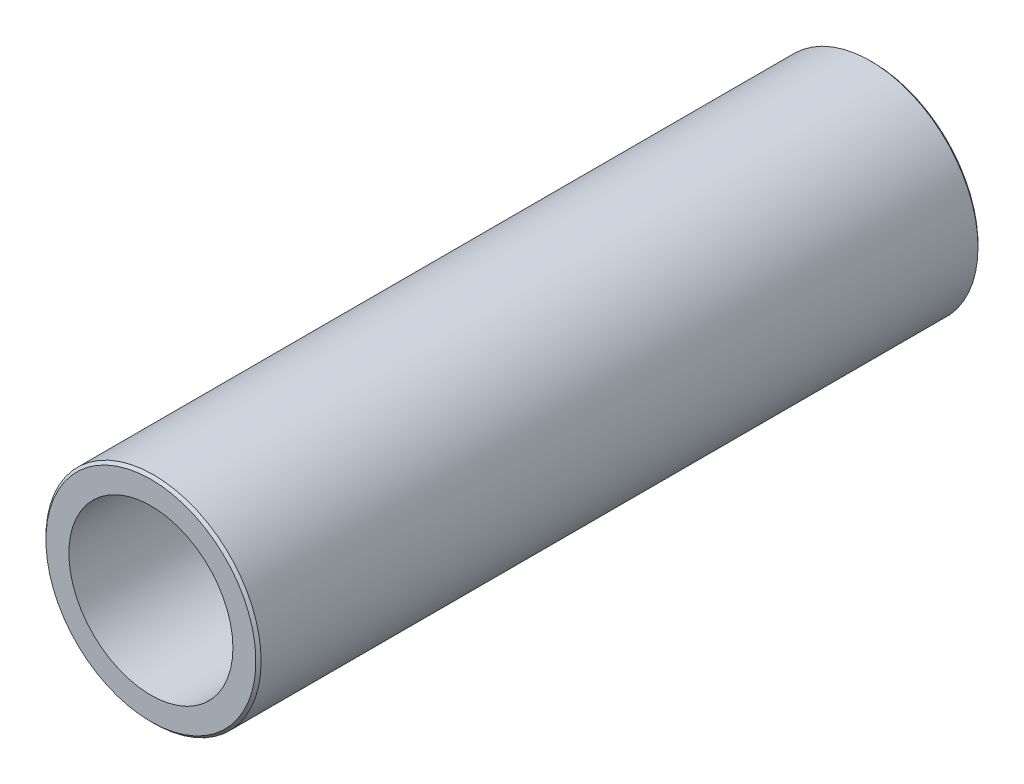
ISO-10303-21;
HEADER;
FILE_DESCRIPTION(('STEP AP214'),'2;1');
FILE_NAME('part.step','',(''),(''),'','','');
FILE_SCHEMA(('AUTOMOTIVE_DESIGN { 1 0 10303 214 1 1 1 1 }'));
ENDSEC;
DATA;
#1=APPLICATION_CONTEXT('core data for automotive mechanical design processes');
#2=APPLICATION_PROTOCOL_DEFINITION('international standard','automotive_design',2000,#1);
#3=PRODUCT_CONTEXT('',#1,'mechanical');
#4=PRODUCT('Part','Part','',(#3));
#5=PRODUCT_RELATED_PRODUCT_CATEGORY('part','',(#4));
#6=PRODUCT_DEFINITION_FORMATION('','',#4);
#7=PRODUCT_DEFINITION_CONTEXT('part definition',#1,'design');
#8=PRODUCT_DEFINITION('design','',#6,#7);
#9=PRODUCT_DEFINITION_SHAPE('','',#8);
#10=(LENGTH_UNIT() NAMED_UNIT(*) SI_UNIT(.MILLI.,.METRE.));
#11=(NAMED_UNIT(*) PLANE_ANGLE_UNIT() SI_UNIT($,.RADIAN.));
#12=(NAMED_UNIT(*) SI_UNIT($,.STERADIAN.) SOLID_ANGLE_UNIT());
#13=UNCERTAINTY_MEASURE_WITH_UNIT(LENGTH_MEASURE(1.E-05),#10,'distance_accuracy_value','');
#14=(GEOMETRIC_REPRESENTATION_CONTEXT(3) GLOBAL_UNCERTAINTY_ASSIGNED_CONTEXT((#13)) GLOBAL_UNIT_ASSIGNED_CONTEXT((#10,
#11,#12)) REPRESENTATION_CONTEXT('',''));
#15=CARTESIAN_POINT('',(0.,0.,0.));
#16=DIRECTION('',(0.,0.,1.));
#17=DIRECTION('',(1.,0.,0.));
#18=AXIS2_PLACEMENT_3D('',#15,#16,#17);
#19=CARTESIAN_POINT('',(0.,0.,-41.9354));
#20=DIRECTION('',(0.,0.,1.));
#21=DIRECTION('',(1.,0.,0.));
#22=AXIS2_PLACEMENT_3D('',#19,#20,#21);
#23=CYLINDRICAL_SURFACE('',#22,9.525);
#24=CARTESIAN_POINT('',(0.,0.,41.9354));
#25=DIRECTION('',(0.,0.,1.));
#26=DIRECTION('',(1.,0.,0.));
#27=AXIS2_PLACEMENT_3D('',#24,#25,#26);
#28=CIRCLE('',#27,9.525);
#29=CARTESIAN_POINT('',(9.525,0.,41.9354));
#30=VERTEX_POINT('',#29);
#31=EDGE_CURVE('E18',#30,#30,#28,.F.);
#32=ORIENTED_EDGE('',*,*,#31,.F.);
#33=EDGE_LOOP('',(#32));
#34=FACE_BOUND('',#33,.T.);
#35=CARTESIAN_POINT('',(0.,0.,-41.9354));
#36=DIRECTION('',(0.,0.,1.));
#37=DIRECTION('',(1.,0.,0.));
#38=AXIS2_PLACEMENT_3D('',#35,#36,#37);
#39=CIRCLE('',#38,9.525);
#40=CARTESIAN_POINT('',(9.525,0.,-41.9354));
#41=VERTEX_POINT('',#40);
#42=EDGE_CURVE('E38',#41,#41,#39,.T.);
#43=ORIENTED_EDGE('',*,*,#42,.F.);
#44=EDGE_LOOP('',(#43));
#45=FACE_BOUND('',#44,.T.);
#46=ADVANCED_FACE('F15',(#34,#45),#23,.F.);
#47=CARTESIAN_POINT('',(0.,12.192,41.9354));
#48=DIRECTION('',(0.,0.,1.));
#49=DIRECTION('',(1.,0.,0.));
#50=AXIS2_PLACEMENT_3D('',#47,#48,#49);
#51=PLANE('',#50);
#52=CARTESIAN_POINT('',(0.,0.,41.9354));
#53=DIRECTION('',(0.,0.,-1.));
#54=DIRECTION('',(0.,1.,0.));
#55=AXIS2_PLACEMENT_3D('',#52,#53,#54);
#56=CIRCLE('',#55,12.192);
#57=CARTESIAN_POINT('',(0.,12.192,41.9354));
#58=VERTEX_POINT('',#57);
#59=EDGE_CURVE('E36',#58,#58,#56,.T.);
#60=ORIENTED_EDGE('',*,*,#59,.F.);
#61=EDGE_LOOP('',(#60));
#62=FACE_BOUND('',#61,.T.);
#63=ORIENTED_EDGE('',*,*,#31,.T.);
#64=EDGE_LOOP('',(#63));
#65=FACE_BOUND('',#64,.T.);
#66=ADVANCED_FACE('F45',(#62,#65),#51,.T.);
#67=CARTESIAN_POINT('',(0.,9.525,-41.9354));
#68=DIRECTION('',(0.,0.,-1.));
#69=DIRECTION('',(-1.,0.,0.));
#70=AXIS2_PLACEMENT_3D('',#67,#68,#69);
#71=PLANE('',#70);
#72=ORIENTED_EDGE('',*,*,#42,.T.);
#73=EDGE_LOOP('',(#72));
#74=FACE_BOUND('',#73,.T.);
#75=CARTESIAN_POINT('',(0.,0.,-41.9354));
#76=DIRECTION('',(0.,0.,1.));
#77=DIRECTION('',(0.,-1.,0.));
#78=AXIS2_PLACEMENT_3D('',#75,#76,#77);
#79=CIRCLE('',#78,12.192);
#80=CARTESIAN_POINT('',(0.,-12.192,-41.9354));
#81=VERTEX_POINT('',#80);
#82=EDGE_CURVE('E27',#81,#81,#79,.T.);
#83=ORIENTED_EDGE('',*,*,#82,.F.);
#84=EDGE_LOOP('',(#83));
#85=FACE_BOUND('',#84,.T.);
#86=ADVANCED_FACE('F53',(#74,#85),#71,.T.);
#87=CARTESIAN_POINT('',(0.,0.,41.6306));
#88=DIRECTION('',(0.,0.,-1.));
#89=DIRECTION('',(0.,1.,0.));
#90=AXIS2_PLACEMENT_3D('',#87,#88,#89);
#91=CONICAL_SURFACE('',#90,12.4968,0.78539816339746);
#92=CARTESIAN_POINT('',(0.,0.,41.6306));
#93=DIRECTION('',(0.,0.,1.));
#94=DIRECTION('',(1.,0.,0.));
#95=AXIS2_PLACEMENT_3D('',#92,#93,#94);
#96=CIRCLE('',#95,12.4968);
#97=CARTESIAN_POINT('',(12.4968,0.,41.6306));
#98=VERTEX_POINT('',#97);
#99=EDGE_CURVE('E22',#98,#98,#96,.F.);
#100=ORIENTED_EDGE('',*,*,#99,.F.);
#101=EDGE_LOOP('',(#100));
#102=FACE_BOUND('',#101,.T.);
#103=ORIENTED_EDGE('',*,*,#59,.T.);
#104=EDGE_LOOP('',(#103));
#105=FACE_BOUND('',#104,.T.);
#106=ADVANCED_FACE('F62',(#102,#105),#91,.T.);
#107=CARTESIAN_POINT('',(0.,0.,-41.6306));
#108=DIRECTION('',(0.,0.,1.));
#109=DIRECTION('',(0.,-1.,0.));
#110=AXIS2_PLACEMENT_3D('',#107,#108,#109);
#111=CONICAL_SURFACE('',#110,12.4968,0.785398163397446);
#112=ORIENTED_EDGE('',*,*,#82,.T.);
#113=EDGE_LOOP('',(#112));
#114=FACE_BOUND('',#113,.T.);
#115=CARTESIAN_POINT('',(0.,0.,-41.6306));
#116=DIRECTION('',(0.,0.,1.));
#117=DIRECTION('',(1.,0.,0.));
#118=AXIS2_PLACEMENT_3D('',#115,#116,#117);
#119=CIRCLE('',#118,12.4968);
#120=CARTESIAN_POINT('',(12.4968,0.,-41.6306));
#121=VERTEX_POINT('',#120);
#122=EDGE_CURVE('E10',#121,#121,#119,.T.);
#123=ORIENTED_EDGE('',*,*,#122,.F.);
#124=EDGE_LOOP('',(#123));
#125=FACE_BOUND('',#124,.T.);
#126=ADVANCED_FACE('F57',(#114,#125),#111,.T.);
#127=CARTESIAN_POINT('',(0.,0.,-41.9354));
#128=DIRECTION('',(0.,0.,1.));
#129=DIRECTION('',(1.,0.,0.));
#130=AXIS2_PLACEMENT_3D('',#127,#128,#129);
#131=CYLINDRICAL_SURFACE('',#130,12.4968);
#132=ORIENTED_EDGE('',*,*,#122,.T.);
#133=EDGE_LOOP('',(#132));
#134=FACE_BOUND('',#133,.T.);
#135=ORIENTED_EDGE('',*,*,#99,.T.);
#136=EDGE_LOOP('',(#135));
#137=FACE_BOUND('',#136,.T.);
#138=ADVANCED_FACE('F55',(#134,#137),#131,.T.);
#139=CLOSED_SHELL('',(#46,#66,#86,#106,#126,#138));
#140=MANIFOLD_SOLID_BREP('B1',#139);
#141=ADVANCED_BREP_SHAPE_REPRESENTATION('',(#18,#140),#14);
#142=SHAPE_DEFINITION_REPRESENTATION(#9,#141);
ENDSEC;
END-ISO-10303-21;
